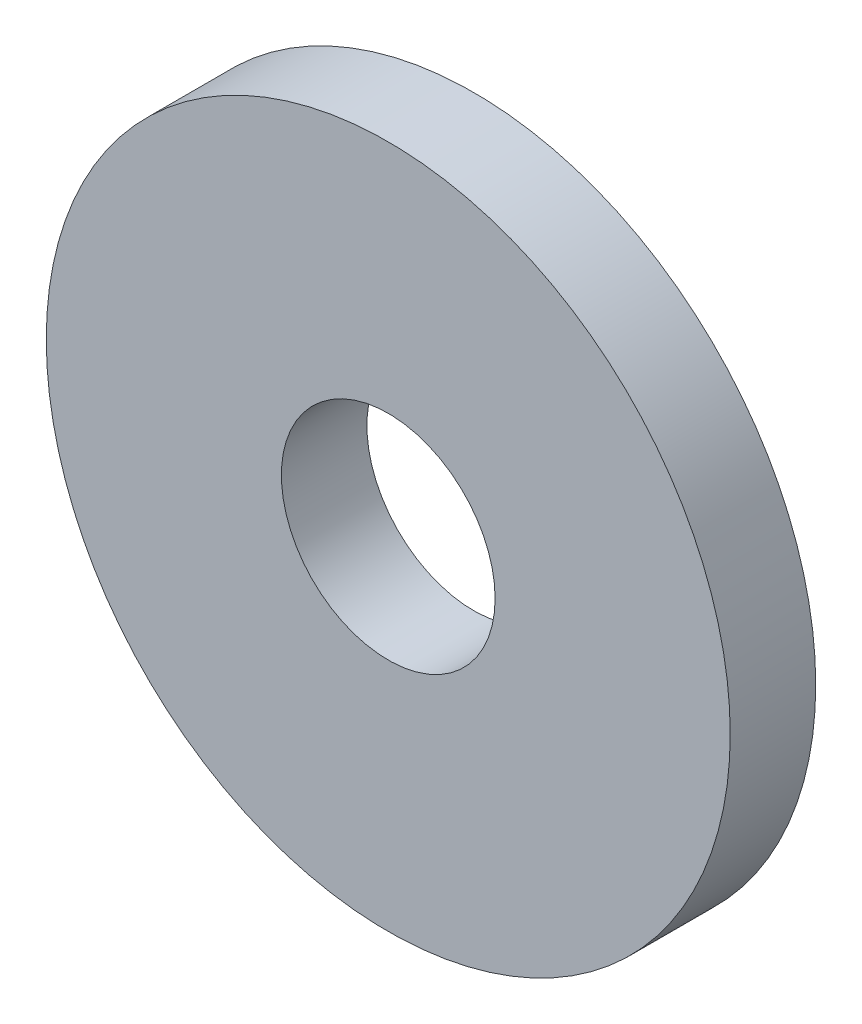
ISO-10303-21;
HEADER;
FILE_DESCRIPTION(('STEP AP214'),'2;1');
FILE_NAME('part.step','',(''),(''),'','','');
FILE_SCHEMA(('AUTOMOTIVE_DESIGN { 1 0 10303 214 1 1 1 1 }'));
ENDSEC;
DATA;
#1=APPLICATION_CONTEXT('core data for automotive mechanical design processes');
#2=APPLICATION_PROTOCOL_DEFINITION('international standard','automotive_design',2000,#1);
#3=PRODUCT_CONTEXT('',#1,'mechanical');
#4=PRODUCT('Part','Part','',(#3));
#5=PRODUCT_RELATED_PRODUCT_CATEGORY('part','',(#4));
#6=PRODUCT_DEFINITION_FORMATION('','',#4);
#7=PRODUCT_DEFINITION_CONTEXT('part definition',#1,'design');
#8=PRODUCT_DEFINITION('design','',#6,#7);
#9=PRODUCT_DEFINITION_SHAPE('','',#8);
#10=(LENGTH_UNIT() NAMED_UNIT(*) SI_UNIT(.MILLI.,.METRE.));
#11=(NAMED_UNIT(*) PLANE_ANGLE_UNIT() SI_UNIT($,.RADIAN.));
#12=(NAMED_UNIT(*) SI_UNIT($,.STERADIAN.) SOLID_ANGLE_UNIT());
#13=UNCERTAINTY_MEASURE_WITH_UNIT(LENGTH_MEASURE(1.E-05),#10,'distance_accuracy_value','');
#14=(GEOMETRIC_REPRESENTATION_CONTEXT(3) GLOBAL_UNCERTAINTY_ASSIGNED_CONTEXT((#13)) GLOBAL_UNIT_ASSIGNED_CONTEXT((#10,
#11,#12)) REPRESENTATION_CONTEXT('',''));
#15=CARTESIAN_POINT('',(0.,0.,0.));
#16=DIRECTION('',(0.,0.,1.));
#17=DIRECTION('',(1.,0.,0.));
#18=AXIS2_PLACEMENT_3D('',#15,#16,#17);
#19=CARTESIAN_POINT('',(0.,0.,2.));
#20=DIRECTION('',(0.,0.,1.));
#21=DIRECTION('',(1.,0.,0.));
#22=AXIS2_PLACEMENT_3D('',#19,#20,#21);
#23=PLANE('',#22);
#24=CARTESIAN_POINT('',(0.,0.,2.));
#25=DIRECTION('',(0.,0.,1.));
#26=DIRECTION('',(1.,0.,0.));
#27=AXIS2_PLACEMENT_3D('',#24,#25,#26);
#28=CIRCLE('',#27,8.);
#29=CARTESIAN_POINT('',(8.,0.,2.));
#30=VERTEX_POINT('',#29);
#31=EDGE_CURVE('E10',#30,#30,#28,.T.);
#32=ORIENTED_EDGE('',*,*,#31,.T.);
#33=EDGE_LOOP('',(#32));
#34=FACE_BOUND('',#33,.T.);
#35=CARTESIAN_POINT('',(0.,0.,2.));
#36=DIRECTION('',(0.,0.,1.));
#37=DIRECTION('',(1.,0.,0.));
#38=AXIS2_PLACEMENT_3D('',#35,#36,#37);
#39=CIRCLE('',#38,2.5);
#40=CARTESIAN_POINT('',(2.5,0.,2.));
#41=VERTEX_POINT('',#40);
#42=EDGE_CURVE('E45',#41,#41,#39,.T.);
#43=ORIENTED_EDGE('',*,*,#42,.F.);
#44=EDGE_LOOP('',(#43));
#45=FACE_BOUND('',#44,.T.);
#46=ADVANCED_FACE('F34',(#34,#45),#23,.T.);
#47=CARTESIAN_POINT('',(0.,0.,0.));
#48=DIRECTION('',(0.,0.,1.));
#49=DIRECTION('',(1.,0.,0.));
#50=AXIS2_PLACEMENT_3D('',#47,#48,#49);
#51=PLANE('',#50);
#52=CARTESIAN_POINT('',(0.,0.,0.));
#53=DIRECTION('',(0.,0.,1.));
#54=DIRECTION('',(1.,0.,0.));
#55=AXIS2_PLACEMENT_3D('',#52,#53,#54);
#56=CIRCLE('',#55,8.);
#57=CARTESIAN_POINT('',(8.,0.,0.));
#58=VERTEX_POINT('',#57);
#59=EDGE_CURVE('E38',#58,#58,#56,.T.);
#60=ORIENTED_EDGE('',*,*,#59,.F.);
#61=EDGE_LOOP('',(#60));
#62=FACE_BOUND('',#61,.T.);
#63=CARTESIAN_POINT('',(0.,0.,0.));
#64=DIRECTION('',(0.,0.,1.));
#65=DIRECTION('',(1.,0.,0.));
#66=AXIS2_PLACEMENT_3D('',#63,#64,#65);
#67=CIRCLE('',#66,2.5);
#68=CARTESIAN_POINT('',(2.5,0.,0.));
#69=VERTEX_POINT('',#68);
#70=EDGE_CURVE('E47',#69,#69,#67,.T.);
#71=ORIENTED_EDGE('',*,*,#70,.T.);
#72=EDGE_LOOP('',(#71));
#73=FACE_BOUND('',#72,.T.);
#74=ADVANCED_FACE('F57',(#62,#73),#51,.F.);
#75=CARTESIAN_POINT('',(0.,0.,2.));
#76=DIRECTION('',(0.,0.,-1.));
#77=DIRECTION('',(-1.,0.,0.));
#78=AXIS2_PLACEMENT_3D('',#75,#76,#77);
#79=CYLINDRICAL_SURFACE('',#78,8.);
#80=ORIENTED_EDGE('',*,*,#31,.F.);
#81=EDGE_LOOP('',(#80));
#82=FACE_BOUND('',#81,.T.);
#83=ORIENTED_EDGE('',*,*,#59,.T.);
#84=EDGE_LOOP('',(#83));
#85=FACE_BOUND('',#84,.T.);
#86=ADVANCED_FACE('F36',(#82,#85),#79,.T.);
#87=CARTESIAN_POINT('',(0.,0.,2.));
#88=DIRECTION('',(0.,0.,-1.));
#89=DIRECTION('',(-1.,0.,0.));
#90=AXIS2_PLACEMENT_3D('',#87,#88,#89);
#91=CYLINDRICAL_SURFACE('',#90,2.5);
#92=ORIENTED_EDGE('',*,*,#42,.T.);
#93=EDGE_LOOP('',(#92));
#94=FACE_BOUND('',#93,.T.);
#95=ORIENTED_EDGE('',*,*,#70,.F.);
#96=EDGE_LOOP('',(#95));
#97=FACE_BOUND('',#96,.T.);
#98=ADVANCED_FACE('F53',(#94,#97),#91,.F.);
#99=CLOSED_SHELL('',(#46,#74,#86,#98));
#100=MANIFOLD_SOLID_BREP('B2',#99);
#101=ADVANCED_BREP_SHAPE_REPRESENTATION('',(#18,#100),#14);
#102=SHAPE_DEFINITION_REPRESENTATION(#9,#101);
ENDSEC;
END-ISO-10303-21;
